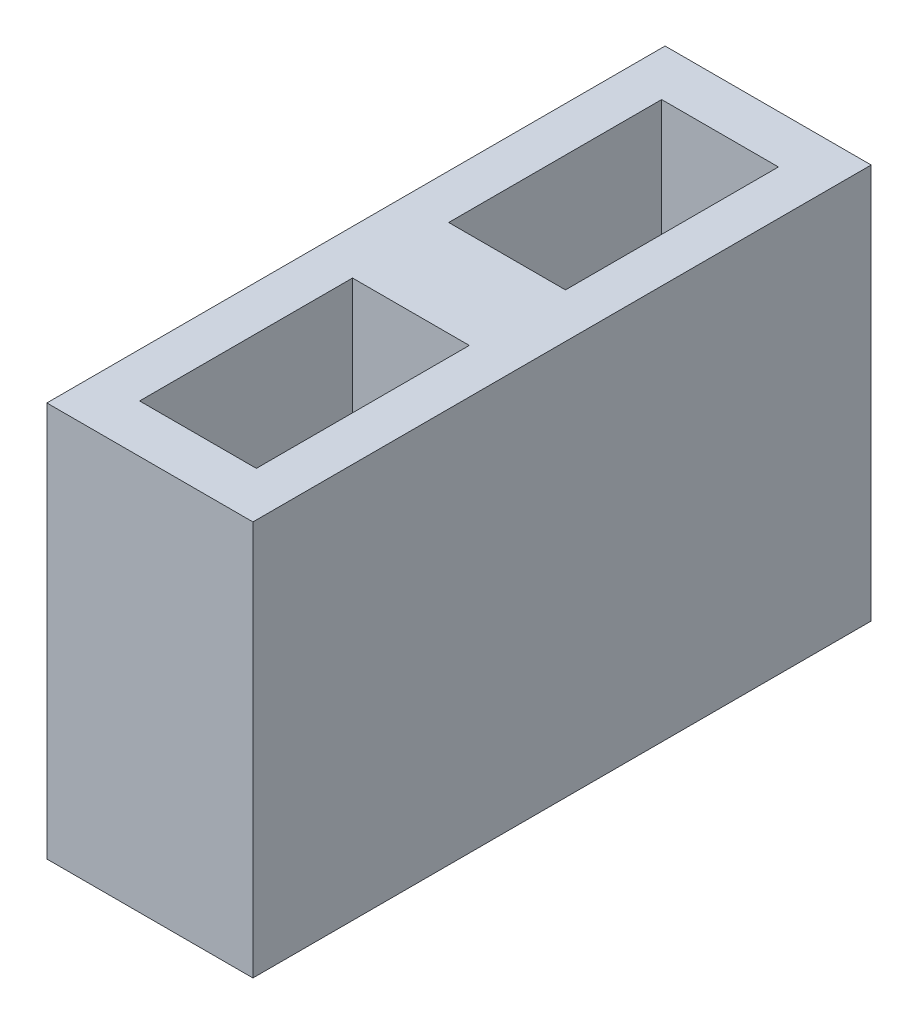
ISO-10303-21;
HEADER;
FILE_DESCRIPTION(('STEP AP214'),'2;1');
FILE_NAME('part.step','',(''),(''),'','','');
FILE_SCHEMA(('AUTOMOTIVE_DESIGN { 1 0 10303 214 1 1 1 1 }'));
ENDSEC;
DATA;
#1=APPLICATION_CONTEXT('core data for automotive mechanical design processes');
#2=APPLICATION_PROTOCOL_DEFINITION('international standard','automotive_design',2000,#1);
#3=PRODUCT_CONTEXT('',#1,'mechanical');
#4=PRODUCT('Part','Part','',(#3));
#5=PRODUCT_RELATED_PRODUCT_CATEGORY('part','',(#4));
#6=PRODUCT_DEFINITION_FORMATION('','',#4);
#7=PRODUCT_DEFINITION_CONTEXT('part definition',#1,'design');
#8=PRODUCT_DEFINITION('design','',#6,#7);
#9=PRODUCT_DEFINITION_SHAPE('','',#8);
#10=(LENGTH_UNIT() NAMED_UNIT(*) SI_UNIT(.MILLI.,.METRE.));
#11=(NAMED_UNIT(*) PLANE_ANGLE_UNIT() SI_UNIT($,.RADIAN.));
#12=(NAMED_UNIT(*) SI_UNIT($,.STERADIAN.) SOLID_ANGLE_UNIT());
#13=UNCERTAINTY_MEASURE_WITH_UNIT(LENGTH_MEASURE(1.E-05),#10,'distance_accuracy_value','');
#14=(GEOMETRIC_REPRESENTATION_CONTEXT(3) GLOBAL_UNCERTAINTY_ASSIGNED_CONTEXT((#13)) GLOBAL_UNIT_ASSIGNED_CONTEXT((#10,
#11,#12)) REPRESENTATION_CONTEXT('',''));
#15=CARTESIAN_POINT('',(0.,0.,0.));
#16=DIRECTION('',(0.,0.,1.));
#17=DIRECTION('',(1.,0.,0.));
#18=AXIS2_PLACEMENT_3D('',#15,#16,#17);
#19=CARTESIAN_POINT('',(0.,1.5,0.));
#20=DIRECTION('',(0.,1.,0.));
#21=DIRECTION('',(0.,0.,1.));
#22=AXIS2_PLACEMENT_3D('',#19,#20,#21);
#23=PLANE('',#22);
#24=DIRECTION('',(-1.,0.,0.));
#25=VECTOR('',#24,1.);
#26=CARTESIAN_POINT('',(-1.4,1.5,-1.4));
#27=LINE('',#26,#25);
#28=CARTESIAN_POINT('',(1.7,1.5,-1.4));
#29=VERTEX_POINT('',#28);
#30=CARTESIAN_POINT('',(-1.7,1.5,-1.4));
#31=VERTEX_POINT('',#30);
#32=EDGE_CURVE('E138',#29,#31,#27,.T.);
#33=ORIENTED_EDGE('',*,*,#32,.F.);
#34=DIRECTION('',(0.,0.,-1.));
#35=VECTOR('',#34,1.);
#36=CARTESIAN_POINT('',(1.7,1.5,-1.7));
#37=LINE('',#36,#35);
#38=CARTESIAN_POINT('',(1.7,1.5,-7.6));
#39=VERTEX_POINT('',#38);
#40=EDGE_CURVE('E129',#29,#39,#37,.T.);
#41=ORIENTED_EDGE('',*,*,#40,.T.);
#42=DIRECTION('',(-1.,0.,0.));
#43=VECTOR('',#42,1.);
#44=CARTESIAN_POINT('',(1.7,1.5,-7.6));
#45=LINE('',#44,#43);
#46=CARTESIAN_POINT('',(-1.7,1.5,-7.6));
#47=VERTEX_POINT('',#46);
#48=EDGE_CURVE('E164',#39,#47,#45,.T.);
#49=ORIENTED_EDGE('',*,*,#48,.T.);
#50=DIRECTION('',(0.,0.,1.));
#51=VECTOR('',#50,1.);
#52=CARTESIAN_POINT('',(-1.7,1.5,-7.6));
#53=LINE('',#52,#51);
#54=EDGE_CURVE('E157',#47,#31,#53,.T.);
#55=ORIENTED_EDGE('',*,*,#54,.T.);
#56=EDGE_LOOP('',(#33,#41,#49,#55));
#57=FACE_BOUND('',#56,.T.);
#58=ADVANCED_FACE('F35',(#57),#23,.T.);
#59=DIRECTION('',(0.,0.,-1.));
#60=VECTOR('',#59,1.);
#61=CARTESIAN_POINT('',(1.7,1.5,7.6));
#62=LINE('',#61,#60);
#63=CARTESIAN_POINT('',(1.7,1.5,7.6));
#64=VERTEX_POINT('',#63);
#65=CARTESIAN_POINT('',(1.7,1.5,1.4));
#66=VERTEX_POINT('',#65);
#67=EDGE_CURVE('E121',#64,#66,#62,.T.);
#68=ORIENTED_EDGE('',*,*,#67,.T.);
#69=DIRECTION('',(1.,0.,0.));
#70=VECTOR('',#69,1.);
#71=CARTESIAN_POINT('',(-1.4,1.5,1.4));
#72=LINE('',#71,#70);
#73=CARTESIAN_POINT('',(-1.7,1.5,1.4));
#74=VERTEX_POINT('',#73);
#75=EDGE_CURVE('E124',#74,#66,#72,.T.);
#76=ORIENTED_EDGE('',*,*,#75,.F.);
#77=DIRECTION('',(0.,0.,1.));
#78=VECTOR('',#77,1.);
#79=CARTESIAN_POINT('',(-1.7,1.5,1.7));
#80=LINE('',#79,#78);
#81=CARTESIAN_POINT('',(-1.7,1.5,7.6));
#82=VERTEX_POINT('',#81);
#83=EDGE_CURVE('E50',#74,#82,#80,.T.);
#84=ORIENTED_EDGE('',*,*,#83,.T.);
#85=DIRECTION('',(1.,0.,0.));
#86=VECTOR('',#85,1.);
#87=CARTESIAN_POINT('',(-1.7,1.5,7.6));
#88=LINE('',#87,#86);
#89=EDGE_CURVE('E55',#82,#64,#88,.T.);
#90=ORIENTED_EDGE('',*,*,#89,.T.);
#91=EDGE_LOOP('',(#68,#76,#84,#90));
#92=FACE_BOUND('',#91,.T.);
#93=ADVANCED_FACE('F123',(#92),#23,.T.);
#94=CARTESIAN_POINT('',(3.,1.5,9.));
#95=DIRECTION('',(0.,0.,-1.));
#96=DIRECTION('',(-1.,0.,0.));
#97=AXIS2_PLACEMENT_3D('',#94,#95,#96);
#98=PLANE('',#97);
#99=DIRECTION('',(1.,0.,0.));
#100=VECTOR('',#99,1.);
#101=CARTESIAN_POINT('',(3.,0.,9.));
#102=LINE('',#101,#100);
#103=CARTESIAN_POINT('',(-3.,0.,9.));
#104=VERTEX_POINT('',#103);
#105=CARTESIAN_POINT('',(3.,0.,9.));
#106=VERTEX_POINT('',#105);
#107=EDGE_CURVE('E199',#104,#106,#102,.T.);
#108=ORIENTED_EDGE('',*,*,#107,.T.);
#109=DIRECTION('',(0.,-1.,0.));
#110=VECTOR('',#109,1.);
#111=CARTESIAN_POINT('',(3.,1.5,9.));
#112=LINE('',#111,#110);
#113=CARTESIAN_POINT('',(3.,11.5,9.));
#114=VERTEX_POINT('',#113);
#115=EDGE_CURVE('E43',#114,#106,#112,.T.);
#116=ORIENTED_EDGE('',*,*,#115,.F.);
#117=DIRECTION('',(1.,0.,0.));
#118=VECTOR('',#117,1.);
#119=CARTESIAN_POINT('',(-3.,11.5,9.));
#120=LINE('',#119,#118);
#121=CARTESIAN_POINT('',(-3.,11.5,9.));
#122=VERTEX_POINT('',#121);
#123=EDGE_CURVE('E191',#122,#114,#120,.T.);
#124=ORIENTED_EDGE('',*,*,#123,.F.);
#125=DIRECTION('',(0.,-1.,0.));
#126=VECTOR('',#125,1.);
#127=CARTESIAN_POINT('',(-3.,1.5,9.));
#128=LINE('',#127,#126);
#129=EDGE_CURVE('E11',#122,#104,#128,.T.);
#130=ORIENTED_EDGE('',*,*,#129,.T.);
#131=EDGE_LOOP('',(#108,#116,#124,#130));
#132=FACE_BOUND('',#131,.T.);
#133=ADVANCED_FACE('F37',(#132),#98,.F.);
#134=CARTESIAN_POINT('',(3.,1.5,-9.));
#135=DIRECTION('',(-1.,0.,0.));
#136=DIRECTION('',(0.,0.,1.));
#137=AXIS2_PLACEMENT_3D('',#134,#135,#136);
#138=PLANE('',#137);
#139=DIRECTION('',(0.,-1.,0.));
#140=VECTOR('',#139,1.);
#141=CARTESIAN_POINT('',(3.,1.5,-9.));
#142=LINE('',#141,#140);
#143=CARTESIAN_POINT('',(3.,11.5,-9.));
#144=VERTEX_POINT('',#143);
#145=CARTESIAN_POINT('',(3.,0.,-9.));
#146=VERTEX_POINT('',#145);
#147=EDGE_CURVE('E211',#144,#146,#142,.T.);
#148=ORIENTED_EDGE('',*,*,#147,.F.);
#149=DIRECTION('',(0.,0.,-1.));
#150=VECTOR('',#149,1.);
#151=CARTESIAN_POINT('',(3.,11.5,9.));
#152=LINE('',#151,#150);
#153=EDGE_CURVE('E194',#114,#144,#152,.T.);
#154=ORIENTED_EDGE('',*,*,#153,.F.);
#155=ORIENTED_EDGE('',*,*,#115,.T.);
#156=DIRECTION('',(0.,0.,-1.));
#157=VECTOR('',#156,1.);
#158=CARTESIAN_POINT('',(3.,0.,-9.));
#159=LINE('',#158,#157);
#160=EDGE_CURVE('E202',#106,#146,#159,.T.);
#161=ORIENTED_EDGE('',*,*,#160,.T.);
#162=EDGE_LOOP('',(#148,#154,#155,#161));
#163=FACE_BOUND('',#162,.T.);
#164=ADVANCED_FACE('F217',(#163),#138,.F.);
#165=CARTESIAN_POINT('',(-3.,1.5,-9.));
#166=DIRECTION('',(0.,0.,1.));
#167=DIRECTION('',(1.,0.,0.));
#168=AXIS2_PLACEMENT_3D('',#165,#166,#167);
#169=PLANE('',#168);
#170=DIRECTION('',(-1.,0.,0.));
#171=VECTOR('',#170,1.);
#172=CARTESIAN_POINT('',(-3.,0.,-9.));
#173=LINE('',#172,#171);
#174=CARTESIAN_POINT('',(-3.,0.,-9.));
#175=VERTEX_POINT('',#174);
#176=EDGE_CURVE('E204',#146,#175,#173,.T.);
#177=ORIENTED_EDGE('',*,*,#176,.T.);
#178=DIRECTION('',(0.,-1.,0.));
#179=VECTOR('',#178,1.);
#180=CARTESIAN_POINT('',(-3.,1.5,-9.));
#181=LINE('',#180,#179);
#182=CARTESIAN_POINT('',(-3.,11.5,-9.));
#183=VERTEX_POINT('',#182);
#184=EDGE_CURVE('E208',#183,#175,#181,.T.);
#185=ORIENTED_EDGE('',*,*,#184,.F.);
#186=DIRECTION('',(-1.,0.,0.));
#187=VECTOR('',#186,1.);
#188=CARTESIAN_POINT('',(3.,11.5,-9.));
#189=LINE('',#188,#187);
#190=EDGE_CURVE('E196',#144,#183,#189,.T.);
#191=ORIENTED_EDGE('',*,*,#190,.F.);
#192=ORIENTED_EDGE('',*,*,#147,.T.);
#193=EDGE_LOOP('',(#177,#185,#191,#192));
#194=FACE_BOUND('',#193,.T.);
#195=ADVANCED_FACE('F234',(#194),#169,.F.);
#196=CARTESIAN_POINT('',(-3.,1.5,-3.));
#197=DIRECTION('',(1.,0.,0.));
#198=DIRECTION('',(0.,0.,-1.));
#199=AXIS2_PLACEMENT_3D('',#196,#197,#198);
#200=PLANE('',#199);
#201=ORIENTED_EDGE('',*,*,#129,.F.);
#202=DIRECTION('',(0.,0.,1.));
#203=VECTOR('',#202,1.);
#204=CARTESIAN_POINT('',(-3.,11.5,-9.));
#205=LINE('',#204,#203);
#206=EDGE_CURVE('E189',#183,#122,#205,.T.);
#207=ORIENTED_EDGE('',*,*,#206,.F.);
#208=ORIENTED_EDGE('',*,*,#184,.T.);
#209=DIRECTION('',(0.,0.,1.));
#210=VECTOR('',#209,1.);
#211=CARTESIAN_POINT('',(-3.,0.,-3.));
#212=LINE('',#211,#210);
#213=EDGE_CURVE('E206',#175,#104,#212,.T.);
#214=ORIENTED_EDGE('',*,*,#213,.T.);
#215=EDGE_LOOP('',(#201,#207,#208,#214));
#216=FACE_BOUND('',#215,.T.);
#217=ADVANCED_FACE('F228',(#216),#200,.F.);
#218=CARTESIAN_POINT('',(0.,0.,0.));
#219=DIRECTION('',(0.,1.,0.));
#220=DIRECTION('',(0.,0.,1.));
#221=AXIS2_PLACEMENT_3D('',#218,#219,#220);
#222=PLANE('',#221);
#223=ORIENTED_EDGE('',*,*,#160,.F.);
#224=ORIENTED_EDGE('',*,*,#107,.F.);
#225=ORIENTED_EDGE('',*,*,#213,.F.);
#226=ORIENTED_EDGE('',*,*,#176,.F.);
#227=EDGE_LOOP('',(#223,#224,#225,#226));
#228=FACE_BOUND('',#227,.T.);
#229=ADVANCED_FACE('F231',(#228),#222,.F.);
#230=CARTESIAN_POINT('',(0.,11.5,0.));
#231=DIRECTION('',(0.,-1.,0.));
#232=DIRECTION('',(0.,0.,-1.));
#233=AXIS2_PLACEMENT_3D('',#230,#231,#232);
#234=PLANE('',#233);
#235=ORIENTED_EDGE('',*,*,#153,.T.);
#236=ORIENTED_EDGE('',*,*,#190,.T.);
#237=ORIENTED_EDGE('',*,*,#206,.T.);
#238=ORIENTED_EDGE('',*,*,#123,.T.);
#239=EDGE_LOOP('',(#235,#236,#237,#238));
#240=FACE_BOUND('',#239,.T.);
#241=DIRECTION('',(0.,0.,-1.));
#242=VECTOR('',#241,1.);
#243=CARTESIAN_POINT('',(1.7,11.5,-1.7));
#244=LINE('',#243,#242);
#245=CARTESIAN_POINT('',(1.7,11.5,-1.4));
#246=VERTEX_POINT('',#245);
#247=CARTESIAN_POINT('',(1.7,11.5,-7.6));
#248=VERTEX_POINT('',#247);
#249=EDGE_CURVE('E169',#246,#248,#244,.T.);
#250=ORIENTED_EDGE('',*,*,#249,.F.);
#251=DIRECTION('',(-1.,0.,0.));
#252=VECTOR('',#251,1.);
#253=CARTESIAN_POINT('',(-1.4,11.5,-1.4));
#254=LINE('',#253,#252);
#255=CARTESIAN_POINT('',(-1.7,11.5,-1.4));
#256=VERTEX_POINT('',#255);
#257=EDGE_CURVE('E155',#246,#256,#254,.T.);
#258=ORIENTED_EDGE('',*,*,#257,.T.);
#259=DIRECTION('',(0.,0.,1.));
#260=VECTOR('',#259,1.);
#261=CARTESIAN_POINT('',(-1.7,11.5,-7.6));
#262=LINE('',#261,#260);
#263=CARTESIAN_POINT('',(-1.7,11.5,-7.6));
#264=VERTEX_POINT('',#263);
#265=EDGE_CURVE('E161',#264,#256,#262,.T.);
#266=ORIENTED_EDGE('',*,*,#265,.F.);
#267=DIRECTION('',(-1.,0.,0.));
#268=VECTOR('',#267,1.);
#269=CARTESIAN_POINT('',(1.7,11.5,-7.6));
#270=LINE('',#269,#268);
#271=EDGE_CURVE('E172',#248,#264,#270,.T.);
#272=ORIENTED_EDGE('',*,*,#271,.F.);
#273=EDGE_LOOP('',(#250,#258,#266,#272));
#274=FACE_BOUND('',#273,.T.);
#275=DIRECTION('',(1.,0.,0.));
#276=VECTOR('',#275,1.);
#277=CARTESIAN_POINT('',(-1.4,11.5,1.4));
#278=LINE('',#277,#276);
#279=CARTESIAN_POINT('',(-1.7,11.5,1.4));
#280=VERTEX_POINT('',#279);
#281=CARTESIAN_POINT('',(1.7,11.5,1.4));
#282=VERTEX_POINT('',#281);
#283=EDGE_CURVE('E153',#280,#282,#278,.T.);
#284=ORIENTED_EDGE('',*,*,#283,.T.);
#285=DIRECTION('',(0.,0.,-1.));
#286=VECTOR('',#285,1.);
#287=CARTESIAN_POINT('',(1.7,11.5,7.6));
#288=LINE('',#287,#286);
#289=CARTESIAN_POINT('',(1.7,11.5,7.6));
#290=VERTEX_POINT('',#289);
#291=EDGE_CURVE('E143',#290,#282,#288,.T.);
#292=ORIENTED_EDGE('',*,*,#291,.F.);
#293=DIRECTION('',(1.,0.,0.));
#294=VECTOR('',#293,1.);
#295=CARTESIAN_POINT('',(-1.7,11.5,7.6));
#296=LINE('',#295,#294);
#297=CARTESIAN_POINT('',(-1.7,11.5,7.6));
#298=VERTEX_POINT('',#297);
#299=EDGE_CURVE('E166',#298,#290,#296,.T.);
#300=ORIENTED_EDGE('',*,*,#299,.F.);
#301=DIRECTION('',(0.,0.,1.));
#302=VECTOR('',#301,1.);
#303=CARTESIAN_POINT('',(-1.7,11.5,1.7));
#304=LINE('',#303,#302);
#305=EDGE_CURVE('E163',#280,#298,#304,.T.);
#306=ORIENTED_EDGE('',*,*,#305,.F.);
#307=EDGE_LOOP('',(#284,#292,#300,#306));
#308=FACE_BOUND('',#307,.T.);
#309=ADVANCED_FACE('F222',(#240,#274,#308),#234,.F.);
#310=CARTESIAN_POINT('',(-1.7,11.5,-7.6));
#311=DIRECTION('',(1.,0.,0.));
#312=DIRECTION('',(0.,0.,-1.));
#313=AXIS2_PLACEMENT_3D('',#310,#311,#312);
#314=PLANE('',#313);
#315=ORIENTED_EDGE('',*,*,#54,.F.);
#316=DIRECTION('',(0.,-1.,0.));
#317=VECTOR('',#316,1.);
#318=CARTESIAN_POINT('',(-1.7,11.5,-7.6));
#319=LINE('',#318,#317);
#320=EDGE_CURVE('E174',#264,#47,#319,.T.);
#321=ORIENTED_EDGE('',*,*,#320,.F.);
#322=ORIENTED_EDGE('',*,*,#265,.T.);
#323=DIRECTION('',(0.,1.,0.));
#324=VECTOR('',#323,1.);
#325=CARTESIAN_POINT('',(-1.7,1.5,-1.4));
#326=LINE('',#325,#324);
#327=EDGE_CURVE('E139',#31,#256,#326,.T.);
#328=ORIENTED_EDGE('',*,*,#327,.F.);
#329=EDGE_LOOP('',(#315,#321,#322,#328));
#330=FACE_BOUND('',#329,.T.);
#331=ADVANCED_FACE('F256',(#330),#314,.T.);
#332=CARTESIAN_POINT('',(-1.7,11.5,1.7));
#333=DIRECTION('',(1.,0.,0.));
#334=DIRECTION('',(0.,0.,-1.));
#335=AXIS2_PLACEMENT_3D('',#332,#333,#334);
#336=PLANE('',#335);
#337=ORIENTED_EDGE('',*,*,#83,.F.);
#338=DIRECTION('',(0.,1.,0.));
#339=VECTOR('',#338,1.);
#340=CARTESIAN_POINT('',(-1.7,1.5,1.4));
#341=LINE('',#340,#339);
#342=EDGE_CURVE('E137',#74,#280,#341,.T.);
#343=ORIENTED_EDGE('',*,*,#342,.T.);
#344=ORIENTED_EDGE('',*,*,#305,.T.);
#345=DIRECTION('',(0.,-1.,0.));
#346=VECTOR('',#345,1.);
#347=CARTESIAN_POINT('',(-1.7,11.5,7.6));
#348=LINE('',#347,#346);
#349=EDGE_CURVE('E187',#298,#82,#348,.T.);
#350=ORIENTED_EDGE('',*,*,#349,.T.);
#351=EDGE_LOOP('',(#337,#343,#344,#350));
#352=FACE_BOUND('',#351,.T.);
#353=ADVANCED_FACE('F260',(#352),#336,.T.);
#354=CARTESIAN_POINT('',(-1.7,11.5,7.6));
#355=DIRECTION('',(0.,0.,-1.));
#356=DIRECTION('',(-1.,0.,0.));
#357=AXIS2_PLACEMENT_3D('',#354,#355,#356);
#358=PLANE('',#357);
#359=ORIENTED_EDGE('',*,*,#89,.F.);
#360=ORIENTED_EDGE('',*,*,#349,.F.);
#361=ORIENTED_EDGE('',*,*,#299,.T.);
#362=DIRECTION('',(0.,-1.,0.));
#363=VECTOR('',#362,1.);
#364=CARTESIAN_POINT('',(1.7,11.5,7.6));
#365=LINE('',#364,#363);
#366=EDGE_CURVE('E185',#290,#64,#365,.T.);
#367=ORIENTED_EDGE('',*,*,#366,.T.);
#368=EDGE_LOOP('',(#359,#360,#361,#367));
#369=FACE_BOUND('',#368,.T.);
#370=ADVANCED_FACE('F265',(#369),#358,.T.);
#371=CARTESIAN_POINT('',(1.7,11.5,7.6));
#372=DIRECTION('',(-1.,0.,0.));
#373=DIRECTION('',(0.,0.,1.));
#374=AXIS2_PLACEMENT_3D('',#371,#372,#373);
#375=PLANE('',#374);
#376=ORIENTED_EDGE('',*,*,#67,.F.);
#377=ORIENTED_EDGE('',*,*,#366,.F.);
#378=ORIENTED_EDGE('',*,*,#291,.T.);
#379=DIRECTION('',(0.,1.,0.));
#380=VECTOR('',#379,1.);
#381=CARTESIAN_POINT('',(1.7,1.5,1.4));
#382=LINE('',#381,#380);
#383=EDGE_CURVE('E135',#66,#282,#382,.T.);
#384=ORIENTED_EDGE('',*,*,#383,.F.);
#385=EDGE_LOOP('',(#376,#377,#378,#384));
#386=FACE_BOUND('',#385,.T.);
#387=ADVANCED_FACE('F141',(#386),#375,.T.);
#388=CARTESIAN_POINT('',(1.7,11.5,-1.7));
#389=DIRECTION('',(-1.,0.,0.));
#390=DIRECTION('',(0.,0.,1.));
#391=AXIS2_PLACEMENT_3D('',#388,#389,#390);
#392=PLANE('',#391);
#393=ORIENTED_EDGE('',*,*,#40,.F.);
#394=DIRECTION('',(0.,1.,0.));
#395=VECTOR('',#394,1.);
#396=CARTESIAN_POINT('',(1.7,1.5,-1.4));
#397=LINE('',#396,#395);
#398=EDGE_CURVE('E145',#29,#246,#397,.T.);
#399=ORIENTED_EDGE('',*,*,#398,.T.);
#400=ORIENTED_EDGE('',*,*,#249,.T.);
#401=DIRECTION('',(0.,-1.,0.));
#402=VECTOR('',#401,1.);
#403=CARTESIAN_POINT('',(1.7,11.5,-7.6));
#404=LINE('',#403,#402);
#405=EDGE_CURVE('E182',#248,#39,#404,.T.);
#406=ORIENTED_EDGE('',*,*,#405,.T.);
#407=EDGE_LOOP('',(#393,#399,#400,#406));
#408=FACE_BOUND('',#407,.T.);
#409=ADVANCED_FACE('F275',(#408),#392,.T.);
#410=CARTESIAN_POINT('',(1.7,11.5,-7.6));
#411=DIRECTION('',(0.,0.,1.));
#412=DIRECTION('',(1.,0.,0.));
#413=AXIS2_PLACEMENT_3D('',#410,#411,#412);
#414=PLANE('',#413);
#415=ORIENTED_EDGE('',*,*,#48,.F.);
#416=ORIENTED_EDGE('',*,*,#405,.F.);
#417=ORIENTED_EDGE('',*,*,#271,.T.);
#418=ORIENTED_EDGE('',*,*,#320,.T.);
#419=EDGE_LOOP('',(#415,#416,#417,#418));
#420=FACE_BOUND('',#419,.T.);
#421=ADVANCED_FACE('F278',(#420),#414,.T.);
#422=CARTESIAN_POINT('',(-1.4,11.5,1.4));
#423=DIRECTION('',(0.,0.,-1.));
#424=DIRECTION('',(-1.,0.,0.));
#425=AXIS2_PLACEMENT_3D('',#422,#423,#424);
#426=PLANE('',#425);
#427=ORIENTED_EDGE('',*,*,#75,.T.);
#428=ORIENTED_EDGE('',*,*,#383,.T.);
#429=ORIENTED_EDGE('',*,*,#283,.F.);
#430=ORIENTED_EDGE('',*,*,#342,.F.);
#431=EDGE_LOOP('',(#427,#428,#429,#430));
#432=FACE_BOUND('',#431,.T.);
#433=ADVANCED_FACE('F133',(#432),#426,.F.);
#434=CARTESIAN_POINT('',(-1.4,11.5,-1.4));
#435=DIRECTION('',(0.,0.,1.));
#436=DIRECTION('',(1.,0.,0.));
#437=AXIS2_PLACEMENT_3D('',#434,#435,#436);
#438=PLANE('',#437);
#439=ORIENTED_EDGE('',*,*,#32,.T.);
#440=ORIENTED_EDGE('',*,*,#327,.T.);
#441=ORIENTED_EDGE('',*,*,#257,.F.);
#442=ORIENTED_EDGE('',*,*,#398,.F.);
#443=EDGE_LOOP('',(#439,#440,#441,#442));
#444=FACE_BOUND('',#443,.T.);
#445=ADVANCED_FACE('F285',(#444),#438,.F.);
#446=CLOSED_SHELL('',(#58,#93,#133,#164,#195,#217,#229,#309,#331,#353,#370,#387,#409,#421,#433,#445));
#447=MANIFOLD_SOLID_BREP('B2',#446);
#448=ADVANCED_BREP_SHAPE_REPRESENTATION('',(#18,#447),#14);
#449=SHAPE_DEFINITION_REPRESENTATION(#9,#448);
ENDSEC;
END-ISO-10303-21;
